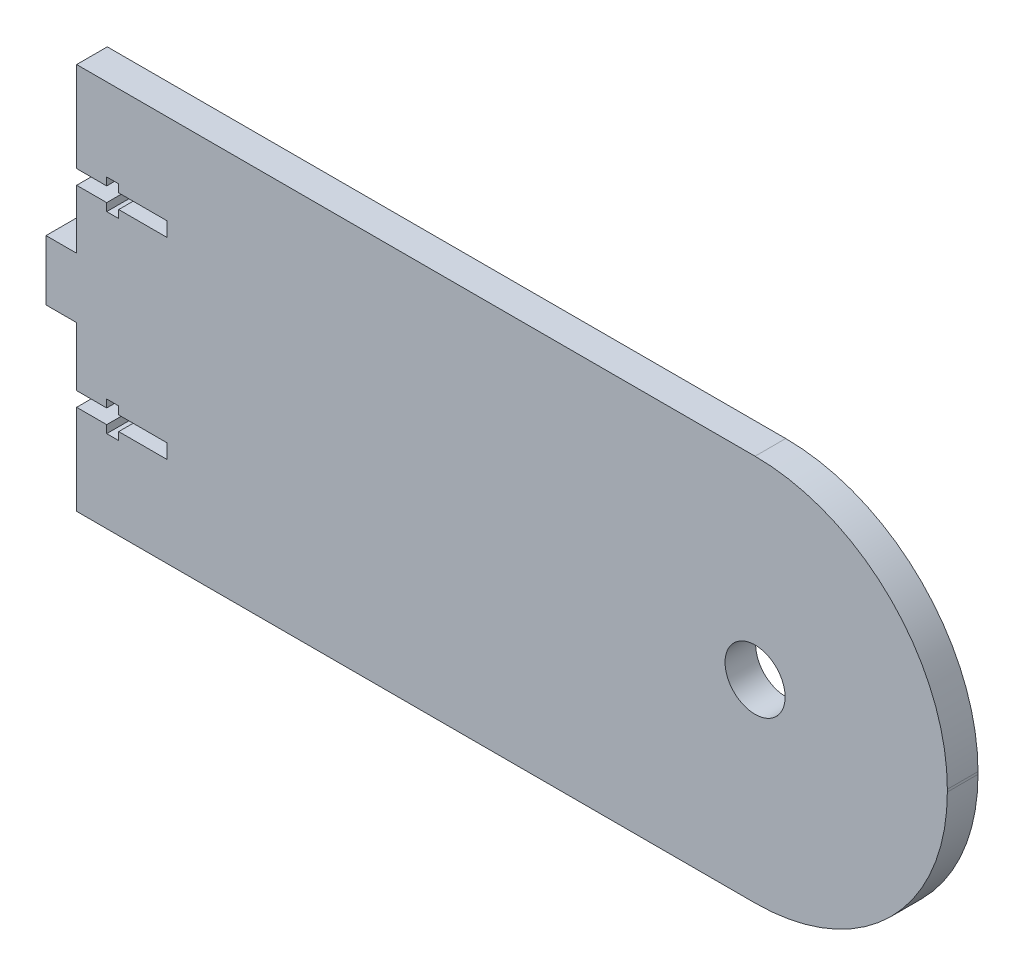
ISO-10303-21;
HEADER;
FILE_DESCRIPTION(('STEP AP214'),'2;1');
FILE_NAME('part.step','',(''),(''),'','','');
FILE_SCHEMA(('AUTOMOTIVE_DESIGN { 1 0 10303 214 1 1 1 1 }'));
ENDSEC;
DATA;
#1=APPLICATION_CONTEXT('core data for automotive mechanical design processes');
#2=APPLICATION_PROTOCOL_DEFINITION('international standard','automotive_design',2000,#1);
#3=PRODUCT_CONTEXT('',#1,'mechanical');
#4=PRODUCT('Part','Part','',(#3));
#5=PRODUCT_RELATED_PRODUCT_CATEGORY('part','',(#4));
#6=PRODUCT_DEFINITION_FORMATION('','',#4);
#7=PRODUCT_DEFINITION_CONTEXT('part definition',#1,'design');
#8=PRODUCT_DEFINITION('design','',#6,#7);
#9=PRODUCT_DEFINITION_SHAPE('','',#8);
#10=(LENGTH_UNIT() NAMED_UNIT(*) SI_UNIT(.MILLI.,.METRE.));
#11=(NAMED_UNIT(*) PLANE_ANGLE_UNIT() SI_UNIT($,.RADIAN.));
#12=(NAMED_UNIT(*) SI_UNIT($,.STERADIAN.) SOLID_ANGLE_UNIT());
#13=UNCERTAINTY_MEASURE_WITH_UNIT(LENGTH_MEASURE(1.E-05),#10,'distance_accuracy_value','');
#14=(GEOMETRIC_REPRESENTATION_CONTEXT(3) GLOBAL_UNCERTAINTY_ASSIGNED_CONTEXT((#13)) GLOBAL_UNIT_ASSIGNED_CONTEXT((#10,
#11,#12)) REPRESENTATION_CONTEXT('',''));
#15=CARTESIAN_POINT('',(0.,0.,0.));
#16=DIRECTION('',(0.,0.,1.));
#17=DIRECTION('',(1.,0.,0.));
#18=AXIS2_PLACEMENT_3D('',#15,#16,#17);
#19=CARTESIAN_POINT('',(95.25,-2.60208521396524E-12,6.477));
#20=DIRECTION('',(-1.,0.,0.));
#21=DIRECTION('',(0.,-1.,0.));
#22=AXIS2_PLACEMENT_3D('',#19,#20,#21);
#23=PLANE('',#22);
#24=DIRECTION('',(0.,1.,0.));
#25=VECTOR('',#24,1.);
#26=CARTESIAN_POINT('',(95.25,-2.60208521396524E-12,0.));
#27=LINE('',#26,#25);
#28=CARTESIAN_POINT('',(95.25,-0.253999999999997,0.));
#29=VERTEX_POINT('',#28);
#30=CARTESIAN_POINT('',(95.25,0.253999999999997,0.));
#31=VERTEX_POINT('',#30);
#32=EDGE_CURVE('E295',#29,#31,#27,.T.);
#33=ORIENTED_EDGE('',*,*,#32,.T.);
#34=DIRECTION('',(0.,0.,-1.));
#35=VECTOR('',#34,1.);
#36=CARTESIAN_POINT('',(95.25,0.253999999999997,6.477));
#37=LINE('',#36,#35);
#38=CARTESIAN_POINT('',(95.25,0.253999999999997,6.477));
#39=VERTEX_POINT('',#38);
#40=EDGE_CURVE('E11',#39,#31,#37,.T.);
#41=ORIENTED_EDGE('',*,*,#40,.F.);
#42=DIRECTION('',(0.,1.,0.));
#43=VECTOR('',#42,1.);
#44=CARTESIAN_POINT('',(95.25,-2.60208521396524E-12,6.477));
#45=LINE('',#44,#43);
#46=CARTESIAN_POINT('',(95.25,-0.253999999999997,6.477));
#47=VERTEX_POINT('',#46);
#48=EDGE_CURVE('E457',#47,#39,#45,.T.);
#49=ORIENTED_EDGE('',*,*,#48,.F.);
#50=DIRECTION('',(0.,0.,-1.));
#51=VECTOR('',#50,1.);
#52=CARTESIAN_POINT('',(95.25,-0.253999999999997,6.477));
#53=LINE('',#52,#51);
#54=EDGE_CURVE('E52',#47,#29,#53,.T.);
#55=ORIENTED_EDGE('',*,*,#54,.T.);
#56=EDGE_LOOP('',(#33,#41,#49,#55));
#57=FACE_BOUND('',#56,.T.);
#58=ADVANCED_FACE('F35',(#57),#23,.F.);
#59=CARTESIAN_POINT('',(54.61,0.253999999999997,6.477));
#60=DIRECTION('',(0.,0.,-1.));
#61=DIRECTION('',(-1.,0.,0.));
#62=AXIS2_PLACEMENT_3D('',#59,#60,#61);
#63=CYLINDRICAL_SURFACE('',#62,40.64);
#64=CARTESIAN_POINT('',(54.61,0.253999999999997,0.));
#65=DIRECTION('',(0.,0.,1.));
#66=DIRECTION('',(1.,0.,0.));
#67=AXIS2_PLACEMENT_3D('',#64,#65,#66);
#68=CIRCLE('',#67,40.64);
#69=CARTESIAN_POINT('',(54.61,40.894,0.));
#70=VERTEX_POINT('',#69);
#71=EDGE_CURVE('E297',#31,#70,#68,.T.);
#72=ORIENTED_EDGE('',*,*,#71,.T.);
#73=DIRECTION('',(0.,0.,-1.));
#74=VECTOR('',#73,1.);
#75=CARTESIAN_POINT('',(54.61,40.894,6.477));
#76=LINE('',#75,#74);
#77=CARTESIAN_POINT('',(54.61,40.894,6.477));
#78=VERTEX_POINT('',#77);
#79=EDGE_CURVE('E44',#78,#70,#76,.T.);
#80=ORIENTED_EDGE('',*,*,#79,.F.);
#81=CARTESIAN_POINT('',(54.61,0.253999999999997,6.477));
#82=DIRECTION('',(0.,0.,1.));
#83=DIRECTION('',(1.,0.,0.));
#84=AXIS2_PLACEMENT_3D('',#81,#82,#83);
#85=CIRCLE('',#84,40.64);
#86=EDGE_CURVE('E169',#39,#78,#85,.T.);
#87=ORIENTED_EDGE('',*,*,#86,.F.);
#88=ORIENTED_EDGE('',*,*,#40,.T.);
#89=EDGE_LOOP('',(#72,#80,#87,#88));
#90=FACE_BOUND('',#89,.T.);
#91=ADVANCED_FACE('F440',(#90),#63,.T.);
#92=CARTESIAN_POINT('',(0.,40.894,6.477));
#93=DIRECTION('',(0.,1.,0.));
#94=DIRECTION('',(0.,0.,1.));
#95=AXIS2_PLACEMENT_3D('',#92,#93,#94);
#96=PLANE('',#95);
#97=DIRECTION('',(1.,0.,0.));
#98=VECTOR('',#97,1.);
#99=CARTESIAN_POINT('',(0.,40.894,0.));
#100=LINE('',#99,#98);
#101=CARTESIAN_POINT('',(-88.773,40.894,0.));
#102=VERTEX_POINT('',#101);
#103=EDGE_CURVE('E300',#102,#70,#100,.T.);
#104=ORIENTED_EDGE('',*,*,#103,.F.);
#105=DIRECTION('',(0.,0.,-1.));
#106=VECTOR('',#105,1.);
#107=CARTESIAN_POINT('',(-88.773,40.894,6.477));
#108=LINE('',#107,#106);
#109=CARTESIAN_POINT('',(-88.773,40.894,6.477));
#110=VERTEX_POINT('',#109);
#111=EDGE_CURVE('E433',#110,#102,#108,.T.);
#112=ORIENTED_EDGE('',*,*,#111,.F.);
#113=DIRECTION('',(1.,0.,0.));
#114=VECTOR('',#113,1.);
#115=CARTESIAN_POINT('',(0.,40.894,6.477));
#116=LINE('',#115,#114);
#117=EDGE_CURVE('E439',#110,#78,#116,.T.);
#118=ORIENTED_EDGE('',*,*,#117,.T.);
#119=ORIENTED_EDGE('',*,*,#79,.T.);
#120=EDGE_LOOP('',(#104,#112,#118,#119));
#121=FACE_BOUND('',#120,.T.);
#122=ADVANCED_FACE('F437',(#121),#96,.T.);
#123=CARTESIAN_POINT('',(-88.773,0.,6.477));
#124=DIRECTION('',(-1.,0.,0.));
#125=DIRECTION('',(0.,0.,1.));
#126=AXIS2_PLACEMENT_3D('',#123,#124,#125);
#127=PLANE('',#126);
#128=DIRECTION('',(0.,1.,0.));
#129=VECTOR('',#128,1.);
#130=CARTESIAN_POINT('',(-88.773,0.,0.));
#131=LINE('',#130,#129);
#132=CARTESIAN_POINT('',(-88.773,21.844,0.));
#133=VERTEX_POINT('',#132);
#134=EDGE_CURVE('E303',#133,#102,#131,.T.);
#135=ORIENTED_EDGE('',*,*,#134,.F.);
#136=DIRECTION('',(0.,0.,-1.));
#137=VECTOR('',#136,1.);
#138=CARTESIAN_POINT('',(-88.773,21.844,6.477));
#139=LINE('',#138,#137);
#140=CARTESIAN_POINT('',(-88.773,21.844,6.477));
#141=VERTEX_POINT('',#140);
#142=EDGE_CURVE('E431',#141,#133,#139,.T.);
#143=ORIENTED_EDGE('',*,*,#142,.F.);
#144=DIRECTION('',(0.,1.,0.));
#145=VECTOR('',#144,1.);
#146=CARTESIAN_POINT('',(-88.773,0.,6.477));
#147=LINE('',#146,#145);
#148=EDGE_CURVE('E452',#141,#110,#147,.T.);
#149=ORIENTED_EDGE('',*,*,#148,.T.);
#150=ORIENTED_EDGE('',*,*,#111,.T.);
#151=EDGE_LOOP('',(#135,#143,#149,#150));
#152=FACE_BOUND('',#151,.T.);
#153=ADVANCED_FACE('F448',(#152),#127,.T.);
#154=CARTESIAN_POINT('',(0.,21.844,6.477));
#155=DIRECTION('',(0.,1.,0.));
#156=DIRECTION('',(-1.,0.,0.));
#157=AXIS2_PLACEMENT_3D('',#154,#155,#156);
#158=PLANE('',#157);
#159=DIRECTION('',(1.,0.,0.));
#160=VECTOR('',#159,1.);
#161=CARTESIAN_POINT('',(0.,21.844,0.));
#162=LINE('',#161,#160);
#163=CARTESIAN_POINT('',(-82.423,21.844,0.));
#164=VERTEX_POINT('',#163);
#165=EDGE_CURVE('E306',#133,#164,#162,.T.);
#166=ORIENTED_EDGE('',*,*,#165,.T.);
#167=DIRECTION('',(0.,0.,-1.));
#168=VECTOR('',#167,1.);
#169=CARTESIAN_POINT('',(-82.423,21.844,6.477));
#170=LINE('',#169,#168);
#171=CARTESIAN_POINT('',(-82.423,21.844,6.477));
#172=VERTEX_POINT('',#171);
#173=EDGE_CURVE('E428',#172,#164,#170,.T.);
#174=ORIENTED_EDGE('',*,*,#173,.F.);
#175=DIRECTION('',(1.,0.,0.));
#176=VECTOR('',#175,1.);
#177=CARTESIAN_POINT('',(0.,21.844,6.477));
#178=LINE('',#177,#176);
#179=EDGE_CURVE('E454',#141,#172,#178,.T.);
#180=ORIENTED_EDGE('',*,*,#179,.F.);
#181=ORIENTED_EDGE('',*,*,#142,.T.);
#182=EDGE_LOOP('',(#166,#174,#180,#181));
#183=FACE_BOUND('',#182,.T.);
#184=ADVANCED_FACE('F560',(#183),#158,.F.);
#185=CARTESIAN_POINT('',(-82.423,0.,6.477));
#186=DIRECTION('',(-1.,0.,0.));
#187=DIRECTION('',(0.,0.,1.));
#188=AXIS2_PLACEMENT_3D('',#185,#186,#187);
#189=PLANE('',#188);
#190=DIRECTION('',(0.,1.,0.));
#191=VECTOR('',#190,1.);
#192=CARTESIAN_POINT('',(-82.423,0.,0.));
#193=LINE('',#192,#191);
#194=CARTESIAN_POINT('',(-82.423,23.495,0.));
#195=VERTEX_POINT('',#194);
#196=EDGE_CURVE('E309',#164,#195,#193,.T.);
#197=ORIENTED_EDGE('',*,*,#196,.T.);
#198=DIRECTION('',(0.,0.,-1.));
#199=VECTOR('',#198,1.);
#200=CARTESIAN_POINT('',(-82.423,23.495,6.477));
#201=LINE('',#200,#199);
#202=CARTESIAN_POINT('',(-82.423,23.495,6.477));
#203=VERTEX_POINT('',#202);
#204=EDGE_CURVE('E425',#203,#195,#201,.T.);
#205=ORIENTED_EDGE('',*,*,#204,.F.);
#206=DIRECTION('',(0.,1.,0.));
#207=VECTOR('',#206,1.);
#208=CARTESIAN_POINT('',(-82.423,0.,6.477));
#209=LINE('',#208,#207);
#210=EDGE_CURVE('E462',#172,#203,#209,.T.);
#211=ORIENTED_EDGE('',*,*,#210,.F.);
#212=ORIENTED_EDGE('',*,*,#173,.T.);
#213=EDGE_LOOP('',(#197,#205,#211,#212));
#214=FACE_BOUND('',#213,.T.);
#215=ADVANCED_FACE('F553',(#214),#189,.F.);
#216=CARTESIAN_POINT('',(0.,23.4949999999999,6.477));
#217=DIRECTION('',(0.,1.,0.));
#218=DIRECTION('',(-1.,0.,0.));
#219=AXIS2_PLACEMENT_3D('',#216,#217,#218);
#220=PLANE('',#219);
#221=DIRECTION('',(1.,0.,0.));
#222=VECTOR('',#221,1.);
#223=CARTESIAN_POINT('',(0.,23.4949999999999,0.));
#224=LINE('',#223,#222);
#225=CARTESIAN_POINT('',(-79.883,23.495,0.));
#226=VERTEX_POINT('',#225);
#227=EDGE_CURVE('E312',#195,#226,#224,.T.);
#228=ORIENTED_EDGE('',*,*,#227,.T.);
#229=DIRECTION('',(0.,0.,-1.));
#230=VECTOR('',#229,1.);
#231=CARTESIAN_POINT('',(-79.883,23.495,6.477));
#232=LINE('',#231,#230);
#233=CARTESIAN_POINT('',(-79.883,23.495,6.477));
#234=VERTEX_POINT('',#233);
#235=EDGE_CURVE('E423',#234,#226,#232,.T.);
#236=ORIENTED_EDGE('',*,*,#235,.F.);
#237=DIRECTION('',(1.,0.,0.));
#238=VECTOR('',#237,1.);
#239=CARTESIAN_POINT('',(0.,23.4949999999999,6.477));
#240=LINE('',#239,#238);
#241=EDGE_CURVE('E465',#203,#234,#240,.T.);
#242=ORIENTED_EDGE('',*,*,#241,.F.);
#243=ORIENTED_EDGE('',*,*,#204,.T.);
#244=EDGE_LOOP('',(#228,#236,#242,#243));
#245=FACE_BOUND('',#244,.T.);
#246=ADVANCED_FACE('F549',(#245),#220,.F.);
#247=CARTESIAN_POINT('',(-79.883,0.,6.477));
#248=DIRECTION('',(-1.,0.,0.));
#249=DIRECTION('',(0.,0.,1.));
#250=AXIS2_PLACEMENT_3D('',#247,#248,#249);
#251=PLANE('',#250);
#252=DIRECTION('',(0.,1.,0.));
#253=VECTOR('',#252,1.);
#254=CARTESIAN_POINT('',(-79.883,0.,0.));
#255=LINE('',#254,#253);
#256=CARTESIAN_POINT('',(-79.883,21.844,0.));
#257=VERTEX_POINT('',#256);
#258=EDGE_CURVE('E316',#257,#226,#255,.T.);
#259=ORIENTED_EDGE('',*,*,#258,.F.);
#260=DIRECTION('',(0.,0.,-1.));
#261=VECTOR('',#260,1.);
#262=CARTESIAN_POINT('',(-79.883,21.844,6.477));
#263=LINE('',#262,#261);
#264=CARTESIAN_POINT('',(-79.883,21.844,6.477));
#265=VERTEX_POINT('',#264);
#266=EDGE_CURVE('E421',#265,#257,#263,.T.);
#267=ORIENTED_EDGE('',*,*,#266,.F.);
#268=DIRECTION('',(0.,1.,0.));
#269=VECTOR('',#268,1.);
#270=CARTESIAN_POINT('',(-79.883,0.,6.477));
#271=LINE('',#270,#269);
#272=EDGE_CURVE('E468',#265,#234,#271,.T.);
#273=ORIENTED_EDGE('',*,*,#272,.T.);
#274=ORIENTED_EDGE('',*,*,#235,.T.);
#275=EDGE_LOOP('',(#259,#267,#273,#274));
#276=FACE_BOUND('',#275,.T.);
#277=ADVANCED_FACE('F552',(#276),#251,.T.);
#278=CARTESIAN_POINT('',(-69.723,21.844,0.));
#279=VERTEX_POINT('',#278);
#280=EDGE_CURVE('E310',#257,#279,#162,.T.);
#281=ORIENTED_EDGE('',*,*,#280,.T.);
#282=DIRECTION('',(0.,0.,-1.));
#283=VECTOR('',#282,1.);
#284=CARTESIAN_POINT('',(-69.723,21.844,6.477));
#285=LINE('',#284,#283);
#286=CARTESIAN_POINT('',(-69.723,21.844,6.477));
#287=VERTEX_POINT('',#286);
#288=EDGE_CURVE('E418',#287,#279,#285,.T.);
#289=ORIENTED_EDGE('',*,*,#288,.F.);
#290=EDGE_CURVE('E463',#265,#287,#178,.T.);
#291=ORIENTED_EDGE('',*,*,#290,.F.);
#292=ORIENTED_EDGE('',*,*,#266,.T.);
#293=EDGE_LOOP('',(#281,#289,#291,#292));
#294=FACE_BOUND('',#293,.T.);
#295=ADVANCED_FACE('F555',(#294),#158,.F.);
#296=CARTESIAN_POINT('',(-69.723,0.,6.477));
#297=DIRECTION('',(1.,0.,0.));
#298=DIRECTION('',(0.,0.,-1.));
#299=AXIS2_PLACEMENT_3D('',#296,#297,#298);
#300=PLANE('',#299);
#301=DIRECTION('',(0.,-1.,0.));
#302=VECTOR('',#301,1.);
#303=CARTESIAN_POINT('',(-69.723,0.,0.));
#304=LINE('',#303,#302);
#305=CARTESIAN_POINT('',(-69.723,18.796,0.));
#306=VERTEX_POINT('',#305);
#307=EDGE_CURVE('E320',#279,#306,#304,.T.);
#308=ORIENTED_EDGE('',*,*,#307,.T.);
#309=DIRECTION('',(0.,0.,-1.));
#310=VECTOR('',#309,1.);
#311=CARTESIAN_POINT('',(-69.723,18.796,6.477));
#312=LINE('',#311,#310);
#313=CARTESIAN_POINT('',(-69.723,18.796,6.477));
#314=VERTEX_POINT('',#313);
#315=EDGE_CURVE('E416',#314,#306,#312,.T.);
#316=ORIENTED_EDGE('',*,*,#315,.F.);
#317=DIRECTION('',(0.,-1.,0.));
#318=VECTOR('',#317,1.);
#319=CARTESIAN_POINT('',(-69.723,0.,6.477));
#320=LINE('',#319,#318);
#321=EDGE_CURVE('E472',#287,#314,#320,.T.);
#322=ORIENTED_EDGE('',*,*,#321,.F.);
#323=ORIENTED_EDGE('',*,*,#288,.T.);
#324=EDGE_LOOP('',(#308,#316,#322,#323));
#325=FACE_BOUND('',#324,.T.);
#326=ADVANCED_FACE('F558',(#325),#300,.F.);
#327=CARTESIAN_POINT('',(0.,18.7959999999999,6.477));
#328=DIRECTION('',(0.,1.,0.));
#329=DIRECTION('',(-1.,0.,0.));
#330=AXIS2_PLACEMENT_3D('',#327,#328,#329);
#331=PLANE('',#330);
#332=DIRECTION('',(1.,0.,0.));
#333=VECTOR('',#332,1.);
#334=CARTESIAN_POINT('',(0.,18.7959999999999,0.));
#335=LINE('',#334,#333);
#336=CARTESIAN_POINT('',(-79.883,18.796,0.));
#337=VERTEX_POINT('',#336);
#338=EDGE_CURVE('E323',#337,#306,#335,.T.);
#339=ORIENTED_EDGE('',*,*,#338,.F.);
#340=DIRECTION('',(0.,0.,-1.));
#341=VECTOR('',#340,1.);
#342=CARTESIAN_POINT('',(-79.883,18.796,6.477));
#343=LINE('',#342,#341);
#344=CARTESIAN_POINT('',(-79.883,18.796,6.477));
#345=VERTEX_POINT('',#344);
#346=EDGE_CURVE('E414',#345,#337,#343,.T.);
#347=ORIENTED_EDGE('',*,*,#346,.F.);
#348=DIRECTION('',(1.,0.,0.));
#349=VECTOR('',#348,1.);
#350=CARTESIAN_POINT('',(0.,18.7959999999999,6.477));
#351=LINE('',#350,#349);
#352=EDGE_CURVE('E474',#345,#314,#351,.T.);
#353=ORIENTED_EDGE('',*,*,#352,.T.);
#354=ORIENTED_EDGE('',*,*,#315,.T.);
#355=EDGE_LOOP('',(#339,#347,#353,#354));
#356=FACE_BOUND('',#355,.T.);
#357=ADVANCED_FACE('F563',(#356),#331,.T.);
#358=CARTESIAN_POINT('',(-79.883,17.145,0.));
#359=VERTEX_POINT('',#358);
#360=EDGE_CURVE('E319',#359,#337,#255,.T.);
#361=ORIENTED_EDGE('',*,*,#360,.F.);
#362=DIRECTION('',(0.,0.,-1.));
#363=VECTOR('',#362,1.);
#364=CARTESIAN_POINT('',(-79.883,17.145,6.477));
#365=LINE('',#364,#363);
#366=CARTESIAN_POINT('',(-79.883,17.145,6.477));
#367=VERTEX_POINT('',#366);
#368=EDGE_CURVE('E412',#367,#359,#365,.T.);
#369=ORIENTED_EDGE('',*,*,#368,.F.);
#370=EDGE_CURVE('E471',#367,#345,#271,.T.);
#371=ORIENTED_EDGE('',*,*,#370,.T.);
#372=ORIENTED_EDGE('',*,*,#346,.T.);
#373=EDGE_LOOP('',(#361,#369,#371,#372));
#374=FACE_BOUND('',#373,.T.);
#375=ADVANCED_FACE('F565',(#374),#251,.T.);
#376=CARTESIAN_POINT('',(0.,17.1450000000001,6.477));
#377=DIRECTION('',(0.,1.,0.));
#378=DIRECTION('',(-1.,0.,0.));
#379=AXIS2_PLACEMENT_3D('',#376,#377,#378);
#380=PLANE('',#379);
#381=DIRECTION('',(1.,0.,0.));
#382=VECTOR('',#381,1.);
#383=CARTESIAN_POINT('',(0.,17.1450000000001,0.));
#384=LINE('',#383,#382);
#385=CARTESIAN_POINT('',(-82.423,17.145,0.));
#386=VERTEX_POINT('',#385);
#387=EDGE_CURVE('E327',#386,#359,#384,.T.);
#388=ORIENTED_EDGE('',*,*,#387,.F.);
#389=DIRECTION('',(0.,0.,-1.));
#390=VECTOR('',#389,1.);
#391=CARTESIAN_POINT('',(-82.423,17.145,6.477));
#392=LINE('',#391,#390);
#393=CARTESIAN_POINT('',(-82.423,17.145,6.477));
#394=VERTEX_POINT('',#393);
#395=EDGE_CURVE('E410',#394,#386,#392,.T.);
#396=ORIENTED_EDGE('',*,*,#395,.F.);
#397=DIRECTION('',(1.,0.,0.));
#398=VECTOR('',#397,1.);
#399=CARTESIAN_POINT('',(0.,17.1450000000001,6.477));
#400=LINE('',#399,#398);
#401=EDGE_CURVE('E478',#394,#367,#400,.T.);
#402=ORIENTED_EDGE('',*,*,#401,.T.);
#403=ORIENTED_EDGE('',*,*,#368,.T.);
#404=EDGE_LOOP('',(#388,#396,#402,#403));
#405=FACE_BOUND('',#404,.T.);
#406=ADVANCED_FACE('F568',(#405),#380,.T.);
#407=CARTESIAN_POINT('',(-82.423,18.796,0.));
#408=VERTEX_POINT('',#407);
#409=EDGE_CURVE('E313',#386,#408,#193,.T.);
#410=ORIENTED_EDGE('',*,*,#409,.T.);
#411=DIRECTION('',(0.,0.,-1.));
#412=VECTOR('',#411,1.);
#413=CARTESIAN_POINT('',(-82.423,18.796,6.477));
#414=LINE('',#413,#412);
#415=CARTESIAN_POINT('',(-82.423,18.796,6.477));
#416=VERTEX_POINT('',#415);
#417=EDGE_CURVE('E408',#416,#408,#414,.T.);
#418=ORIENTED_EDGE('',*,*,#417,.F.);
#419=EDGE_CURVE('E466',#394,#416,#209,.T.);
#420=ORIENTED_EDGE('',*,*,#419,.F.);
#421=ORIENTED_EDGE('',*,*,#395,.T.);
#422=EDGE_LOOP('',(#410,#418,#420,#421));
#423=FACE_BOUND('',#422,.T.);
#424=ADVANCED_FACE('F572',(#423),#189,.F.);
#425=CARTESIAN_POINT('',(-88.773,18.796,0.));
#426=VERTEX_POINT('',#425);
#427=EDGE_CURVE('E326',#426,#408,#335,.T.);
#428=ORIENTED_EDGE('',*,*,#427,.F.);
#429=DIRECTION('',(0.,0.,-1.));
#430=VECTOR('',#429,1.);
#431=CARTESIAN_POINT('',(-88.773,18.796,6.477));
#432=LINE('',#431,#430);
#433=CARTESIAN_POINT('',(-88.773,18.796,6.477));
#434=VERTEX_POINT('',#433);
#435=EDGE_CURVE('E406',#434,#426,#432,.T.);
#436=ORIENTED_EDGE('',*,*,#435,.F.);
#437=EDGE_CURVE('E477',#434,#416,#351,.T.);
#438=ORIENTED_EDGE('',*,*,#437,.T.);
#439=ORIENTED_EDGE('',*,*,#417,.T.);
#440=EDGE_LOOP('',(#428,#436,#438,#439));
#441=FACE_BOUND('',#440,.T.);
#442=ADVANCED_FACE('F576',(#441),#331,.T.);
#443=CARTESIAN_POINT('',(-88.773,6.35,0.));
#444=VERTEX_POINT('',#443);
#445=EDGE_CURVE('E307',#444,#426,#131,.T.);
#446=ORIENTED_EDGE('',*,*,#445,.F.);
#447=DIRECTION('',(0.,0.,-1.));
#448=VECTOR('',#447,1.);
#449=CARTESIAN_POINT('',(-88.773,6.35,6.477));
#450=LINE('',#449,#448);
#451=CARTESIAN_POINT('',(-88.773,6.35,6.477));
#452=VERTEX_POINT('',#451);
#453=EDGE_CURVE('E404',#452,#444,#450,.T.);
#454=ORIENTED_EDGE('',*,*,#453,.F.);
#455=EDGE_CURVE('E456',#452,#434,#147,.T.);
#456=ORIENTED_EDGE('',*,*,#455,.T.);
#457=ORIENTED_EDGE('',*,*,#435,.T.);
#458=EDGE_LOOP('',(#446,#454,#456,#457));
#459=FACE_BOUND('',#458,.T.);
#460=ADVANCED_FACE('F580',(#459),#127,.T.);
#461=CARTESIAN_POINT('',(0.,6.35000000000005,6.477));
#462=DIRECTION('',(0.,1.,0.));
#463=DIRECTION('',(-1.,0.,0.));
#464=AXIS2_PLACEMENT_3D('',#461,#462,#463);
#465=PLANE('',#464);
#466=DIRECTION('',(1.,0.,0.));
#467=VECTOR('',#466,1.);
#468=CARTESIAN_POINT('',(0.,6.35000000000005,0.));
#469=LINE('',#468,#467);
#470=CARTESIAN_POINT('',(-95.25,6.35,0.));
#471=VERTEX_POINT('',#470);
#472=EDGE_CURVE('E330',#471,#444,#469,.T.);
#473=ORIENTED_EDGE('',*,*,#472,.F.);
#474=DIRECTION('',(0.,0.,-1.));
#475=VECTOR('',#474,1.);
#476=CARTESIAN_POINT('',(-95.25,6.35,6.477));
#477=LINE('',#476,#475);
#478=CARTESIAN_POINT('',(-95.25,6.35,6.477));
#479=VERTEX_POINT('',#478);
#480=EDGE_CURVE('E402',#479,#471,#477,.T.);
#481=ORIENTED_EDGE('',*,*,#480,.F.);
#482=DIRECTION('',(1.,0.,0.));
#483=VECTOR('',#482,1.);
#484=CARTESIAN_POINT('',(0.,6.35000000000005,6.477));
#485=LINE('',#484,#483);
#486=EDGE_CURVE('E481',#479,#452,#485,.T.);
#487=ORIENTED_EDGE('',*,*,#486,.T.);
#488=ORIENTED_EDGE('',*,*,#453,.T.);
#489=EDGE_LOOP('',(#473,#481,#487,#488));
#490=FACE_BOUND('',#489,.T.);
#491=ADVANCED_FACE('F584',(#490),#465,.T.);
#492=CARTESIAN_POINT('',(-95.25,0.,6.477));
#493=DIRECTION('',(-1.,0.,0.));
#494=DIRECTION('',(0.,0.,1.));
#495=AXIS2_PLACEMENT_3D('',#492,#493,#494);
#496=PLANE('',#495);
#497=DIRECTION('',(0.,1.,0.));
#498=VECTOR('',#497,1.);
#499=CARTESIAN_POINT('',(-95.25,0.,0.));
#500=LINE('',#499,#498);
#501=CARTESIAN_POINT('',(-95.25,-6.34999999999999,0.));
#502=VERTEX_POINT('',#501);
#503=EDGE_CURVE('E333',#502,#471,#500,.T.);
#504=ORIENTED_EDGE('',*,*,#503,.F.);
#505=DIRECTION('',(0.,0.,-1.));
#506=VECTOR('',#505,1.);
#507=CARTESIAN_POINT('',(-95.25,-6.34999999999999,6.477));
#508=LINE('',#507,#506);
#509=CARTESIAN_POINT('',(-95.25,-6.34999999999999,6.477));
#510=VERTEX_POINT('',#509);
#511=EDGE_CURVE('E400',#510,#502,#508,.T.);
#512=ORIENTED_EDGE('',*,*,#511,.F.);
#513=DIRECTION('',(0.,1.,0.));
#514=VECTOR('',#513,1.);
#515=CARTESIAN_POINT('',(-95.25,0.,6.477));
#516=LINE('',#515,#514);
#517=EDGE_CURVE('E484',#510,#479,#516,.T.);
#518=ORIENTED_EDGE('',*,*,#517,.T.);
#519=ORIENTED_EDGE('',*,*,#480,.T.);
#520=EDGE_LOOP('',(#504,#512,#518,#519));
#521=FACE_BOUND('',#520,.T.);
#522=ADVANCED_FACE('F588',(#521),#496,.T.);
#523=CARTESIAN_POINT('',(0.,-6.34999999999999,6.477));
#524=DIRECTION('',(0.,1.,0.));
#525=DIRECTION('',(0.,0.,1.));
#526=AXIS2_PLACEMENT_3D('',#523,#524,#525);
#527=PLANE('',#526);
#528=DIRECTION('',(1.,0.,0.));
#529=VECTOR('',#528,1.);
#530=CARTESIAN_POINT('',(0.,-6.34999999999999,0.));
#531=LINE('',#530,#529);
#532=CARTESIAN_POINT('',(-88.773,-6.34999999999999,0.));
#533=VERTEX_POINT('',#532);
#534=EDGE_CURVE('E336',#502,#533,#531,.T.);
#535=ORIENTED_EDGE('',*,*,#534,.T.);
#536=DIRECTION('',(0.,0.,-1.));
#537=VECTOR('',#536,1.);
#538=CARTESIAN_POINT('',(-88.773,-6.34999999999999,6.477));
#539=LINE('',#538,#537);
#540=CARTESIAN_POINT('',(-88.773,-6.34999999999999,6.477));
#541=VERTEX_POINT('',#540);
#542=EDGE_CURVE('E397',#541,#533,#539,.T.);
#543=ORIENTED_EDGE('',*,*,#542,.F.);
#544=DIRECTION('',(1.,0.,0.));
#545=VECTOR('',#544,1.);
#546=CARTESIAN_POINT('',(0.,-6.34999999999999,6.477));
#547=LINE('',#546,#545);
#548=EDGE_CURVE('E487',#510,#541,#547,.T.);
#549=ORIENTED_EDGE('',*,*,#548,.F.);
#550=ORIENTED_EDGE('',*,*,#511,.T.);
#551=EDGE_LOOP('',(#535,#543,#549,#550));
#552=FACE_BOUND('',#551,.T.);
#553=ADVANCED_FACE('F592',(#552),#527,.F.);
#554=CARTESIAN_POINT('',(-88.773,0.,6.477));
#555=DIRECTION('',(1.,0.,0.));
#556=DIRECTION('',(0.,0.,-1.));
#557=AXIS2_PLACEMENT_3D('',#554,#555,#556);
#558=PLANE('',#557);
#559=DIRECTION('',(0.,-1.,0.));
#560=VECTOR('',#559,1.);
#561=CARTESIAN_POINT('',(-88.773,0.,0.));
#562=LINE('',#561,#560);
#563=CARTESIAN_POINT('',(-88.773,-18.796,0.));
#564=VERTEX_POINT('',#563);
#565=EDGE_CURVE('E338',#533,#564,#562,.T.);
#566=ORIENTED_EDGE('',*,*,#565,.T.);
#567=DIRECTION('',(0.,0.,-1.));
#568=VECTOR('',#567,1.);
#569=CARTESIAN_POINT('',(-88.773,-18.796,6.477));
#570=LINE('',#569,#568);
#571=CARTESIAN_POINT('',(-88.773,-18.796,6.477));
#572=VERTEX_POINT('',#571);
#573=EDGE_CURVE('E394',#572,#564,#570,.T.);
#574=ORIENTED_EDGE('',*,*,#573,.F.);
#575=DIRECTION('',(0.,-1.,0.));
#576=VECTOR('',#575,1.);
#577=CARTESIAN_POINT('',(-88.773,0.,6.477));
#578=LINE('',#577,#576);
#579=EDGE_CURVE('E274',#541,#572,#578,.T.);
#580=ORIENTED_EDGE('',*,*,#579,.F.);
#581=ORIENTED_EDGE('',*,*,#542,.T.);
#582=EDGE_LOOP('',(#566,#574,#580,#581));
#583=FACE_BOUND('',#582,.T.);
#584=ADVANCED_FACE('F596',(#583),#558,.F.);
#585=CARTESIAN_POINT('',(0.,-18.7959999999999,6.477));
#586=DIRECTION('',(0.,1.,0.));
#587=DIRECTION('',(-1.,0.,0.));
#588=AXIS2_PLACEMENT_3D('',#585,#586,#587);
#589=PLANE('',#588);
#590=DIRECTION('',(1.,0.,0.));
#591=VECTOR('',#590,1.);
#592=CARTESIAN_POINT('',(0.,-18.7959999999999,0.));
#593=LINE('',#592,#591);
#594=CARTESIAN_POINT('',(-82.423,-18.796,0.));
#595=VERTEX_POINT('',#594);
#596=EDGE_CURVE('E340',#564,#595,#593,.T.);
#597=ORIENTED_EDGE('',*,*,#596,.T.);
#598=DIRECTION('',(0.,0.,-1.));
#599=VECTOR('',#598,1.);
#600=CARTESIAN_POINT('',(-82.423,-18.796,6.477));
#601=LINE('',#600,#599);
#602=CARTESIAN_POINT('',(-82.423,-18.796,6.477));
#603=VERTEX_POINT('',#602);
#604=EDGE_CURVE('E392',#603,#595,#601,.T.);
#605=ORIENTED_EDGE('',*,*,#604,.F.);
#606=DIRECTION('',(1.,0.,0.));
#607=VECTOR('',#606,1.);
#608=CARTESIAN_POINT('',(0.,-18.7959999999999,6.477));
#609=LINE('',#608,#607);
#610=EDGE_CURVE('E489',#572,#603,#609,.T.);
#611=ORIENTED_EDGE('',*,*,#610,.F.);
#612=ORIENTED_EDGE('',*,*,#573,.T.);
#613=EDGE_LOOP('',(#597,#605,#611,#612));
#614=FACE_BOUND('',#613,.T.);
#615=ADVANCED_FACE('F609',(#614),#589,.F.);
#616=CARTESIAN_POINT('',(-82.423,0.,6.477));
#617=DIRECTION('',(1.,0.,0.));
#618=DIRECTION('',(0.,0.,-1.));
#619=AXIS2_PLACEMENT_3D('',#616,#617,#618);
#620=PLANE('',#619);
#621=DIRECTION('',(0.,-1.,0.));
#622=VECTOR('',#621,1.);
#623=CARTESIAN_POINT('',(-82.423,0.,0.));
#624=LINE('',#623,#622);
#625=CARTESIAN_POINT('',(-82.423,-17.145,0.));
#626=VERTEX_POINT('',#625);
#627=EDGE_CURVE('E343',#626,#595,#624,.T.);
#628=ORIENTED_EDGE('',*,*,#627,.F.);
#629=DIRECTION('',(0.,0.,-1.));
#630=VECTOR('',#629,1.);
#631=CARTESIAN_POINT('',(-82.423,-17.145,6.477));
#632=LINE('',#631,#630);
#633=CARTESIAN_POINT('',(-82.423,-17.145,6.477));
#634=VERTEX_POINT('',#633);
#635=EDGE_CURVE('E390',#634,#626,#632,.T.);
#636=ORIENTED_EDGE('',*,*,#635,.F.);
#637=DIRECTION('',(0.,-1.,0.));
#638=VECTOR('',#637,1.);
#639=CARTESIAN_POINT('',(-82.423,0.,6.477));
#640=LINE('',#639,#638);
#641=EDGE_CURVE('E491',#634,#603,#640,.T.);
#642=ORIENTED_EDGE('',*,*,#641,.T.);
#643=ORIENTED_EDGE('',*,*,#604,.T.);
#644=EDGE_LOOP('',(#628,#636,#642,#643));
#645=FACE_BOUND('',#644,.T.);
#646=ADVANCED_FACE('F602',(#645),#620,.T.);
#647=CARTESIAN_POINT('',(0.,-17.1450000000001,6.477));
#648=DIRECTION('',(0.,1.,0.));
#649=DIRECTION('',(-1.,0.,0.));
#650=AXIS2_PLACEMENT_3D('',#647,#648,#649);
#651=PLANE('',#650);
#652=DIRECTION('',(1.,0.,0.));
#653=VECTOR('',#652,1.);
#654=CARTESIAN_POINT('',(0.,-17.1450000000001,0.));
#655=LINE('',#654,#653);
#656=CARTESIAN_POINT('',(-79.883,-17.145,0.));
#657=VERTEX_POINT('',#656);
#658=EDGE_CURVE('E347',#626,#657,#655,.T.);
#659=ORIENTED_EDGE('',*,*,#658,.T.);
#660=DIRECTION('',(0.,0.,-1.));
#661=VECTOR('',#660,1.);
#662=CARTESIAN_POINT('',(-79.883,-17.145,6.477));
#663=LINE('',#662,#661);
#664=CARTESIAN_POINT('',(-79.883,-17.145,6.477));
#665=VERTEX_POINT('',#664);
#666=EDGE_CURVE('E387',#665,#657,#663,.T.);
#667=ORIENTED_EDGE('',*,*,#666,.F.);
#668=DIRECTION('',(1.,0.,0.));
#669=VECTOR('',#668,1.);
#670=CARTESIAN_POINT('',(0.,-17.1450000000001,6.477));
#671=LINE('',#670,#669);
#672=EDGE_CURVE('E495',#634,#665,#671,.T.);
#673=ORIENTED_EDGE('',*,*,#672,.F.);
#674=ORIENTED_EDGE('',*,*,#635,.T.);
#675=EDGE_LOOP('',(#659,#667,#673,#674));
#676=FACE_BOUND('',#675,.T.);
#677=ADVANCED_FACE('F598',(#676),#651,.F.);
#678=CARTESIAN_POINT('',(-79.883,0.,6.477));
#679=DIRECTION('',(1.,0.,0.));
#680=DIRECTION('',(0.,0.,-1.));
#681=AXIS2_PLACEMENT_3D('',#678,#679,#680);
#682=PLANE('',#681);
#683=DIRECTION('',(0.,-1.,0.));
#684=VECTOR('',#683,1.);
#685=CARTESIAN_POINT('',(-79.883,0.,0.));
#686=LINE('',#685,#684);
#687=CARTESIAN_POINT('',(-79.883,-18.796,0.));
#688=VERTEX_POINT('',#687);
#689=EDGE_CURVE('E350',#657,#688,#686,.T.);
#690=ORIENTED_EDGE('',*,*,#689,.T.);
#691=DIRECTION('',(0.,0.,-1.));
#692=VECTOR('',#691,1.);
#693=CARTESIAN_POINT('',(-79.883,-18.796,6.477));
#694=LINE('',#693,#692);
#695=CARTESIAN_POINT('',(-79.883,-18.796,6.477));
#696=VERTEX_POINT('',#695);
#697=EDGE_CURVE('E384',#696,#688,#694,.T.);
#698=ORIENTED_EDGE('',*,*,#697,.F.);
#699=DIRECTION('',(0.,-1.,0.));
#700=VECTOR('',#699,1.);
#701=CARTESIAN_POINT('',(-79.883,0.,6.477));
#702=LINE('',#701,#700);
#703=EDGE_CURVE('E498',#665,#696,#702,.T.);
#704=ORIENTED_EDGE('',*,*,#703,.F.);
#705=ORIENTED_EDGE('',*,*,#666,.T.);
#706=EDGE_LOOP('',(#690,#698,#704,#705));
#707=FACE_BOUND('',#706,.T.);
#708=ADVANCED_FACE('F601',(#707),#682,.F.);
#709=CARTESIAN_POINT('',(-69.723,-18.796,0.));
#710=VERTEX_POINT('',#709);
#711=EDGE_CURVE('E344',#688,#710,#593,.T.);
#712=ORIENTED_EDGE('',*,*,#711,.T.);
#713=DIRECTION('',(0.,0.,-1.));
#714=VECTOR('',#713,1.);
#715=CARTESIAN_POINT('',(-69.723,-18.796,6.477));
#716=LINE('',#715,#714);
#717=CARTESIAN_POINT('',(-69.723,-18.796,6.477));
#718=VERTEX_POINT('',#717);
#719=EDGE_CURVE('E382',#718,#710,#716,.T.);
#720=ORIENTED_EDGE('',*,*,#719,.F.);
#721=EDGE_CURVE('E492',#696,#718,#609,.T.);
#722=ORIENTED_EDGE('',*,*,#721,.F.);
#723=ORIENTED_EDGE('',*,*,#697,.T.);
#724=EDGE_LOOP('',(#712,#720,#722,#723));
#725=FACE_BOUND('',#724,.T.);
#726=ADVANCED_FACE('F604',(#725),#589,.F.);
#727=CARTESIAN_POINT('',(-69.723,0.,6.477));
#728=DIRECTION('',(-1.,0.,0.));
#729=DIRECTION('',(0.,0.,1.));
#730=AXIS2_PLACEMENT_3D('',#727,#728,#729);
#731=PLANE('',#730);
#732=DIRECTION('',(0.,1.,0.));
#733=VECTOR('',#732,1.);
#734=CARTESIAN_POINT('',(-69.723,0.,0.));
#735=LINE('',#734,#733);
#736=CARTESIAN_POINT('',(-69.723,-21.844,0.));
#737=VERTEX_POINT('',#736);
#738=EDGE_CURVE('E353',#737,#710,#735,.T.);
#739=ORIENTED_EDGE('',*,*,#738,.F.);
#740=DIRECTION('',(0.,0.,-1.));
#741=VECTOR('',#740,1.);
#742=CARTESIAN_POINT('',(-69.723,-21.844,6.477));
#743=LINE('',#742,#741);
#744=CARTESIAN_POINT('',(-69.723,-21.844,6.477));
#745=VERTEX_POINT('',#744);
#746=EDGE_CURVE('E380',#745,#737,#743,.T.);
#747=ORIENTED_EDGE('',*,*,#746,.F.);
#748=DIRECTION('',(0.,1.,0.));
#749=VECTOR('',#748,1.);
#750=CARTESIAN_POINT('',(-69.723,0.,6.477));
#751=LINE('',#750,#749);
#752=EDGE_CURVE('E501',#745,#718,#751,.T.);
#753=ORIENTED_EDGE('',*,*,#752,.T.);
#754=ORIENTED_EDGE('',*,*,#719,.T.);
#755=EDGE_LOOP('',(#739,#747,#753,#754));
#756=FACE_BOUND('',#755,.T.);
#757=ADVANCED_FACE('F607',(#756),#731,.T.);
#758=CARTESIAN_POINT('',(0.,-21.844,6.477));
#759=DIRECTION('',(0.,1.,0.));
#760=DIRECTION('',(-1.,0.,0.));
#761=AXIS2_PLACEMENT_3D('',#758,#759,#760);
#762=PLANE('',#761);
#763=DIRECTION('',(1.,0.,0.));
#764=VECTOR('',#763,1.);
#765=CARTESIAN_POINT('',(0.,-21.844,0.));
#766=LINE('',#765,#764);
#767=CARTESIAN_POINT('',(-79.883,-21.844,0.));
#768=VERTEX_POINT('',#767);
#769=EDGE_CURVE('E356',#768,#737,#766,.T.);
#770=ORIENTED_EDGE('',*,*,#769,.F.);
#771=DIRECTION('',(0.,0.,-1.));
#772=VECTOR('',#771,1.);
#773=CARTESIAN_POINT('',(-79.883,-21.844,6.477));
#774=LINE('',#773,#772);
#775=CARTESIAN_POINT('',(-79.883,-21.844,6.477));
#776=VERTEX_POINT('',#775);
#777=EDGE_CURVE('E378',#776,#768,#774,.T.);
#778=ORIENTED_EDGE('',*,*,#777,.F.);
#779=DIRECTION('',(1.,0.,0.));
#780=VECTOR('',#779,1.);
#781=CARTESIAN_POINT('',(0.,-21.844,6.477));
#782=LINE('',#781,#780);
#783=EDGE_CURVE('E503',#776,#745,#782,.T.);
#784=ORIENTED_EDGE('',*,*,#783,.T.);
#785=ORIENTED_EDGE('',*,*,#746,.T.);
#786=EDGE_LOOP('',(#770,#778,#784,#785));
#787=FACE_BOUND('',#786,.T.);
#788=ADVANCED_FACE('F612',(#787),#762,.T.);
#789=CARTESIAN_POINT('',(-79.883,-23.495,0.));
#790=VERTEX_POINT('',#789);
#791=EDGE_CURVE('E352',#768,#790,#686,.T.);
#792=ORIENTED_EDGE('',*,*,#791,.T.);
#793=DIRECTION('',(0.,0.,-1.));
#794=VECTOR('',#793,1.);
#795=CARTESIAN_POINT('',(-79.883,-23.495,6.477));
#796=LINE('',#795,#794);
#797=CARTESIAN_POINT('',(-79.883,-23.495,6.477));
#798=VERTEX_POINT('',#797);
#799=EDGE_CURVE('E376',#798,#790,#796,.T.);
#800=ORIENTED_EDGE('',*,*,#799,.F.);
#801=EDGE_CURVE('E500',#776,#798,#702,.T.);
#802=ORIENTED_EDGE('',*,*,#801,.F.);
#803=ORIENTED_EDGE('',*,*,#777,.T.);
#804=EDGE_LOOP('',(#792,#800,#802,#803));
#805=FACE_BOUND('',#804,.T.);
#806=ADVANCED_FACE('F520',(#805),#682,.F.);
#807=CARTESIAN_POINT('',(0.,-23.4949999999999,6.477));
#808=DIRECTION('',(0.,1.,0.));
#809=DIRECTION('',(-1.,0.,0.));
#810=AXIS2_PLACEMENT_3D('',#807,#808,#809);
#811=PLANE('',#810);
#812=DIRECTION('',(1.,0.,0.));
#813=VECTOR('',#812,1.);
#814=CARTESIAN_POINT('',(0.,-23.4949999999999,0.));
#815=LINE('',#814,#813);
#816=CARTESIAN_POINT('',(-82.423,-23.495,0.));
#817=VERTEX_POINT('',#816);
#818=EDGE_CURVE('E360',#817,#790,#815,.T.);
#819=ORIENTED_EDGE('',*,*,#818,.F.);
#820=DIRECTION('',(0.,0.,-1.));
#821=VECTOR('',#820,1.);
#822=CARTESIAN_POINT('',(-82.423,-23.495,6.477));
#823=LINE('',#822,#821);
#824=CARTESIAN_POINT('',(-82.423,-23.495,6.477));
#825=VERTEX_POINT('',#824);
#826=EDGE_CURVE('E374',#825,#817,#823,.T.);
#827=ORIENTED_EDGE('',*,*,#826,.F.);
#828=DIRECTION('',(1.,0.,0.));
#829=VECTOR('',#828,1.);
#830=CARTESIAN_POINT('',(0.,-23.4949999999999,6.477));
#831=LINE('',#830,#829);
#832=EDGE_CURVE('E289',#825,#798,#831,.T.);
#833=ORIENTED_EDGE('',*,*,#832,.T.);
#834=ORIENTED_EDGE('',*,*,#799,.T.);
#835=EDGE_LOOP('',(#819,#827,#833,#834));
#836=FACE_BOUND('',#835,.T.);
#837=ADVANCED_FACE('F514',(#836),#811,.T.);
#838=CARTESIAN_POINT('',(-82.423,-21.844,0.));
#839=VERTEX_POINT('',#838);
#840=EDGE_CURVE('E348',#839,#817,#624,.T.);
#841=ORIENTED_EDGE('',*,*,#840,.F.);
#842=DIRECTION('',(0.,0.,-1.));
#843=VECTOR('',#842,1.);
#844=CARTESIAN_POINT('',(-82.423,-21.844,6.477));
#845=LINE('',#844,#843);
#846=CARTESIAN_POINT('',(-82.423,-21.844,6.477));
#847=VERTEX_POINT('',#846);
#848=EDGE_CURVE('E372',#847,#839,#845,.T.);
#849=ORIENTED_EDGE('',*,*,#848,.F.);
#850=EDGE_CURVE('E496',#847,#825,#640,.T.);
#851=ORIENTED_EDGE('',*,*,#850,.T.);
#852=ORIENTED_EDGE('',*,*,#826,.T.);
#853=EDGE_LOOP('',(#841,#849,#851,#852));
#854=FACE_BOUND('',#853,.T.);
#855=ADVANCED_FACE('F527',(#854),#620,.T.);
#856=CARTESIAN_POINT('',(-88.773,-21.844,0.));
#857=VERTEX_POINT('',#856);
#858=EDGE_CURVE('E359',#857,#839,#766,.T.);
#859=ORIENTED_EDGE('',*,*,#858,.F.);
#860=DIRECTION('',(0.,0.,-1.));
#861=VECTOR('',#860,1.);
#862=CARTESIAN_POINT('',(-88.773,-21.844,6.477));
#863=LINE('',#862,#861);
#864=CARTESIAN_POINT('',(-88.773,-21.844,6.477));
#865=VERTEX_POINT('',#864);
#866=EDGE_CURVE('E282',#865,#857,#863,.T.);
#867=ORIENTED_EDGE('',*,*,#866,.F.);
#868=EDGE_CURVE('E271',#865,#847,#782,.T.);
#869=ORIENTED_EDGE('',*,*,#868,.T.);
#870=ORIENTED_EDGE('',*,*,#848,.T.);
#871=EDGE_LOOP('',(#859,#867,#869,#870));
#872=FACE_BOUND('',#871,.T.);
#873=ADVANCED_FACE('F528',(#872),#762,.T.);
#874=CARTESIAN_POINT('',(-88.773,-40.894,0.));
#875=VERTEX_POINT('',#874);
#876=EDGE_CURVE('E279',#857,#875,#562,.T.);
#877=ORIENTED_EDGE('',*,*,#876,.T.);
#878=DIRECTION('',(0.,0.,-1.));
#879=VECTOR('',#878,1.);
#880=CARTESIAN_POINT('',(-88.773,-40.894,6.477));
#881=LINE('',#880,#879);
#882=CARTESIAN_POINT('',(-88.773,-40.894,6.477));
#883=VERTEX_POINT('',#882);
#884=EDGE_CURVE('E276',#883,#875,#881,.T.);
#885=ORIENTED_EDGE('',*,*,#884,.F.);
#886=EDGE_CURVE('E263',#865,#883,#578,.T.);
#887=ORIENTED_EDGE('',*,*,#886,.F.);
#888=ORIENTED_EDGE('',*,*,#866,.T.);
#889=EDGE_LOOP('',(#877,#885,#887,#888));
#890=FACE_BOUND('',#889,.T.);
#891=ADVANCED_FACE('F277',(#890),#558,.F.);
#892=CARTESIAN_POINT('',(0.,-40.894,6.477));
#893=DIRECTION('',(0.,1.,0.));
#894=DIRECTION('',(0.,0.,1.));
#895=AXIS2_PLACEMENT_3D('',#892,#893,#894);
#896=PLANE('',#895);
#897=DIRECTION('',(1.,0.,0.));
#898=VECTOR('',#897,1.);
#899=CARTESIAN_POINT('',(0.,-40.894,0.));
#900=LINE('',#899,#898);
#901=CARTESIAN_POINT('',(54.61,-40.894,0.));
#902=VERTEX_POINT('',#901);
#903=EDGE_CURVE('E363',#875,#902,#900,.T.);
#904=ORIENTED_EDGE('',*,*,#903,.T.);
#905=DIRECTION('',(0.,0.,-1.));
#906=VECTOR('',#905,1.);
#907=CARTESIAN_POINT('',(54.61,-40.894,6.477));
#908=LINE('',#907,#906);
#909=CARTESIAN_POINT('',(54.61,-40.894,6.477));
#910=VERTEX_POINT('',#909);
#911=EDGE_CURVE('E157',#910,#902,#908,.T.);
#912=ORIENTED_EDGE('',*,*,#911,.F.);
#913=DIRECTION('',(1.,0.,0.));
#914=VECTOR('',#913,1.);
#915=CARTESIAN_POINT('',(0.,-40.894,6.477));
#916=LINE('',#915,#914);
#917=EDGE_CURVE('E268',#883,#910,#916,.T.);
#918=ORIENTED_EDGE('',*,*,#917,.F.);
#919=ORIENTED_EDGE('',*,*,#884,.T.);
#920=EDGE_LOOP('',(#904,#912,#918,#919));
#921=FACE_BOUND('',#920,.T.);
#922=ADVANCED_FACE('F284',(#921),#896,.F.);
#923=CARTESIAN_POINT('',(54.61,0.,6.477));
#924=DIRECTION('',(0.,0.,-1.));
#925=DIRECTION('',(-1.,0.,0.));
#926=AXIS2_PLACEMENT_3D('',#923,#924,#925);
#927=CYLINDRICAL_SURFACE('',#926,6.35);
#928=CARTESIAN_POINT('',(54.61,0.,6.477));
#929=DIRECTION('',(0.,0.,1.));
#930=DIRECTION('',(1.,0.,0.));
#931=AXIS2_PLACEMENT_3D('',#928,#929,#930);
#932=CIRCLE('',#931,6.35);
#933=CARTESIAN_POINT('',(60.96,0.,6.477));
#934=VERTEX_POINT('',#933);
#935=EDGE_CURVE('E368',#934,#934,#932,.T.);
#936=ORIENTED_EDGE('',*,*,#935,.T.);
#937=EDGE_LOOP('',(#936));
#938=FACE_BOUND('',#937,.T.);
#939=CARTESIAN_POINT('',(54.61,0.,0.));
#940=DIRECTION('',(0.,0.,1.));
#941=DIRECTION('',(1.,0.,0.));
#942=AXIS2_PLACEMENT_3D('',#939,#940,#941);
#943=CIRCLE('',#942,6.35);
#944=CARTESIAN_POINT('',(60.96,0.,0.));
#945=VERTEX_POINT('',#944);
#946=EDGE_CURVE('E292',#945,#945,#943,.T.);
#947=ORIENTED_EDGE('',*,*,#946,.F.);
#948=EDGE_LOOP('',(#947));
#949=FACE_BOUND('',#948,.T.);
#950=ADVANCED_FACE('F37',(#938,#949),#927,.F.);
#951=CARTESIAN_POINT('',(54.61,-0.253999999999997,6.477));
#952=DIRECTION('',(0.,0.,-1.));
#953=DIRECTION('',(-1.,0.,0.));
#954=AXIS2_PLACEMENT_3D('',#951,#952,#953);
#955=CYLINDRICAL_SURFACE('',#954,40.64);
#956=CARTESIAN_POINT('',(54.61,-0.253999999999997,0.));
#957=DIRECTION('',(0.,0.,1.));
#958=DIRECTION('',(1.,0.,0.));
#959=AXIS2_PLACEMENT_3D('',#956,#957,#958);
#960=CIRCLE('',#959,40.64);
#961=EDGE_CURVE('E365',#29,#902,#960,.F.);
#962=ORIENTED_EDGE('',*,*,#961,.F.);
#963=ORIENTED_EDGE('',*,*,#54,.F.);
#964=CARTESIAN_POINT('',(54.61,-0.253999999999997,6.477));
#965=DIRECTION('',(0.,0.,1.));
#966=DIRECTION('',(1.,0.,0.));
#967=AXIS2_PLACEMENT_3D('',#964,#965,#966);
#968=CIRCLE('',#967,40.64);
#969=EDGE_CURVE('E285',#47,#910,#968,.F.);
#970=ORIENTED_EDGE('',*,*,#969,.T.);
#971=ORIENTED_EDGE('',*,*,#911,.T.);
#972=EDGE_LOOP('',(#962,#963,#970,#971));
#973=FACE_BOUND('',#972,.T.);
#974=ADVANCED_FACE('F529',(#973),#955,.T.);
#975=CARTESIAN_POINT('',(0.,0.,6.477));
#976=DIRECTION('',(0.,0.,1.));
#977=DIRECTION('',(1.,0.,0.));
#978=AXIS2_PLACEMENT_3D('',#975,#976,#977);
#979=PLANE('',#978);
#980=ORIENTED_EDGE('',*,*,#935,.F.);
#981=EDGE_LOOP('',(#980));
#982=FACE_BOUND('',#981,.T.);
#983=ORIENTED_EDGE('',*,*,#48,.T.);
#984=ORIENTED_EDGE('',*,*,#86,.T.);
#985=ORIENTED_EDGE('',*,*,#117,.F.);
#986=ORIENTED_EDGE('',*,*,#148,.F.);
#987=ORIENTED_EDGE('',*,*,#179,.T.);
#988=ORIENTED_EDGE('',*,*,#210,.T.);
#989=ORIENTED_EDGE('',*,*,#241,.T.);
#990=ORIENTED_EDGE('',*,*,#272,.F.);
#991=ORIENTED_EDGE('',*,*,#290,.T.);
#992=ORIENTED_EDGE('',*,*,#321,.T.);
#993=ORIENTED_EDGE('',*,*,#352,.F.);
#994=ORIENTED_EDGE('',*,*,#370,.F.);
#995=ORIENTED_EDGE('',*,*,#401,.F.);
#996=ORIENTED_EDGE('',*,*,#419,.T.);
#997=ORIENTED_EDGE('',*,*,#437,.F.);
#998=ORIENTED_EDGE('',*,*,#455,.F.);
#999=ORIENTED_EDGE('',*,*,#486,.F.);
#1000=ORIENTED_EDGE('',*,*,#517,.F.);
#1001=ORIENTED_EDGE('',*,*,#548,.T.);
#1002=ORIENTED_EDGE('',*,*,#579,.T.);
#1003=ORIENTED_EDGE('',*,*,#610,.T.);
#1004=ORIENTED_EDGE('',*,*,#641,.F.);
#1005=ORIENTED_EDGE('',*,*,#672,.T.);
#1006=ORIENTED_EDGE('',*,*,#703,.T.);
#1007=ORIENTED_EDGE('',*,*,#721,.T.);
#1008=ORIENTED_EDGE('',*,*,#752,.F.);
#1009=ORIENTED_EDGE('',*,*,#783,.F.);
#1010=ORIENTED_EDGE('',*,*,#801,.T.);
#1011=ORIENTED_EDGE('',*,*,#832,.F.);
#1012=ORIENTED_EDGE('',*,*,#850,.F.);
#1013=ORIENTED_EDGE('',*,*,#868,.F.);
#1014=ORIENTED_EDGE('',*,*,#886,.T.);
#1015=ORIENTED_EDGE('',*,*,#917,.T.);
#1016=ORIENTED_EDGE('',*,*,#969,.F.);
#1017=EDGE_LOOP('',(#983,#984,#985,#986,#987,#988,#989,#990,#991,#992,#993,#994,#995,#996,#997,
#998,#999,#1000,#1001,#1002,#1003,#1004,#1005,#1006,#1007,#1008,#1009,#1010,#1011,#1012,#1013,
#1014,#1015,#1016));
#1018=FACE_BOUND('',#1017,.T.);
#1019=ADVANCED_FACE('F265',(#982,#1018),#979,.T.);
#1020=CARTESIAN_POINT('',(0.,0.,0.));
#1021=DIRECTION('',(0.,0.,1.));
#1022=DIRECTION('',(1.,0.,0.));
#1023=AXIS2_PLACEMENT_3D('',#1020,#1021,#1022);
#1024=PLANE('',#1023);
#1025=ORIENTED_EDGE('',*,*,#946,.T.);
#1026=EDGE_LOOP('',(#1025));
#1027=FACE_BOUND('',#1026,.T.);
#1028=ORIENTED_EDGE('',*,*,#32,.F.);
#1029=ORIENTED_EDGE('',*,*,#961,.T.);
#1030=ORIENTED_EDGE('',*,*,#903,.F.);
#1031=ORIENTED_EDGE('',*,*,#876,.F.);
#1032=ORIENTED_EDGE('',*,*,#858,.T.);
#1033=ORIENTED_EDGE('',*,*,#840,.T.);
#1034=ORIENTED_EDGE('',*,*,#818,.T.);
#1035=ORIENTED_EDGE('',*,*,#791,.F.);
#1036=ORIENTED_EDGE('',*,*,#769,.T.);
#1037=ORIENTED_EDGE('',*,*,#738,.T.);
#1038=ORIENTED_EDGE('',*,*,#711,.F.);
#1039=ORIENTED_EDGE('',*,*,#689,.F.);
#1040=ORIENTED_EDGE('',*,*,#658,.F.);
#1041=ORIENTED_EDGE('',*,*,#627,.T.);
#1042=ORIENTED_EDGE('',*,*,#596,.F.);
#1043=ORIENTED_EDGE('',*,*,#565,.F.);
#1044=ORIENTED_EDGE('',*,*,#534,.F.);
#1045=ORIENTED_EDGE('',*,*,#503,.T.);
#1046=ORIENTED_EDGE('',*,*,#472,.T.);
#1047=ORIENTED_EDGE('',*,*,#445,.T.);
#1048=ORIENTED_EDGE('',*,*,#427,.T.);
#1049=ORIENTED_EDGE('',*,*,#409,.F.);
#1050=ORIENTED_EDGE('',*,*,#387,.T.);
#1051=ORIENTED_EDGE('',*,*,#360,.T.);
#1052=ORIENTED_EDGE('',*,*,#338,.T.);
#1053=ORIENTED_EDGE('',*,*,#307,.F.);
#1054=ORIENTED_EDGE('',*,*,#280,.F.);
#1055=ORIENTED_EDGE('',*,*,#258,.T.);
#1056=ORIENTED_EDGE('',*,*,#227,.F.);
#1057=ORIENTED_EDGE('',*,*,#196,.F.);
#1058=ORIENTED_EDGE('',*,*,#165,.F.);
#1059=ORIENTED_EDGE('',*,*,#134,.T.);
#1060=ORIENTED_EDGE('',*,*,#103,.T.);
#1061=ORIENTED_EDGE('',*,*,#71,.F.);
#1062=EDGE_LOOP('',(#1028,#1029,#1030,#1031,#1032,#1033,#1034,#1035,#1036,#1037,#1038,#1039,
#1040,#1041,#1042,#1043,#1044,#1045,#1046,#1047,#1048,#1049,#1050,#1051,#1052,#1053,#1054,#1055,
#1056,#1057,#1058,#1059,#1060,#1061));
#1063=FACE_BOUND('',#1062,.T.);
#1064=ADVANCED_FACE('F443',(#1027,#1063),#1024,.F.);
#1065=CLOSED_SHELL('',(#58,#91,#122,#153,#184,#215,#246,#277,#295,#326,#357,#375,#406,#424,#442,
#460,#491,#522,#553,#584,#615,#646,#677,#708,#726,#757,#788,#806,#837,#855,#873,#891,#922,#950,
#974,#1019,#1064));
#1066=MANIFOLD_SOLID_BREP('B2',#1065);
#1067=ADVANCED_BREP_SHAPE_REPRESENTATION('',(#18,#1066),#14);
#1068=SHAPE_DEFINITION_REPRESENTATION(#9,#1067);
ENDSEC;
END-ISO-10303-21;
